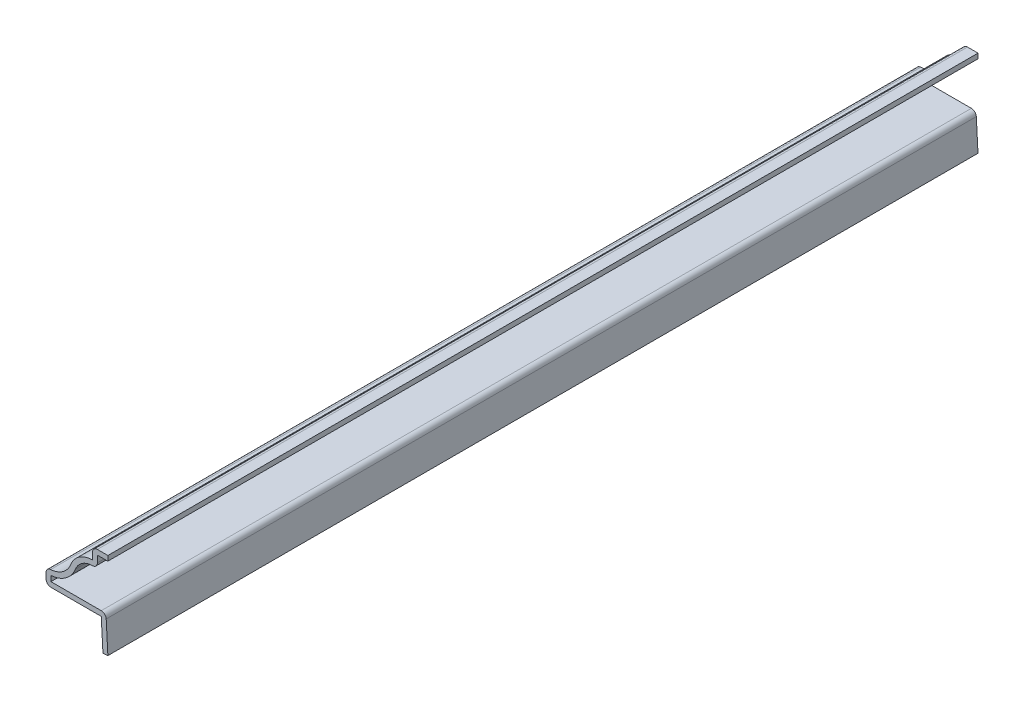
ISO-10303-21;
HEADER;
FILE_DESCRIPTION(('STEP AP214'),'2;1');
FILE_NAME('part.step','',(''),(''),'','','');
FILE_SCHEMA(('AUTOMOTIVE_DESIGN { 1 0 10303 214 1 1 1 1 }'));
ENDSEC;
DATA;
#1=APPLICATION_CONTEXT('core data for automotive mechanical design processes');
#2=APPLICATION_PROTOCOL_DEFINITION('international standard','automotive_design',2000,#1);
#3=PRODUCT_CONTEXT('',#1,'mechanical');
#4=PRODUCT('Part','Part','',(#3));
#5=PRODUCT_RELATED_PRODUCT_CATEGORY('part','',(#4));
#6=PRODUCT_DEFINITION_FORMATION('','',#4);
#7=PRODUCT_DEFINITION_CONTEXT('part definition',#1,'design');
#8=PRODUCT_DEFINITION('design','',#6,#7);
#9=PRODUCT_DEFINITION_SHAPE('','',#8);
#10=(LENGTH_UNIT() NAMED_UNIT(*) SI_UNIT(.MILLI.,.METRE.));
#11=(NAMED_UNIT(*) PLANE_ANGLE_UNIT() SI_UNIT($,.RADIAN.));
#12=(NAMED_UNIT(*) SI_UNIT($,.STERADIAN.) SOLID_ANGLE_UNIT());
#13=UNCERTAINTY_MEASURE_WITH_UNIT(LENGTH_MEASURE(1.E-05),#10,'distance_accuracy_value','');
#14=(GEOMETRIC_REPRESENTATION_CONTEXT(3) GLOBAL_UNCERTAINTY_ASSIGNED_CONTEXT((#13)) GLOBAL_UNIT_ASSIGNED_CONTEXT((#10,
#11,#12)) REPRESENTATION_CONTEXT('',''));
#15=CARTESIAN_POINT('',(0.,0.,0.));
#16=DIRECTION('',(0.,0.,1.));
#17=DIRECTION('',(1.,0.,0.));
#18=AXIS2_PLACEMENT_3D('',#15,#16,#17);
#19=CARTESIAN_POINT('',(-1.35921717219366,6.35,-178.59375));
#20=DIRECTION('',(-0.998529808230198,-0.0542053694366461,0.));
#21=DIRECTION('',(0.0542053694366461,-0.998529808230198,0.));
#22=AXIS2_PLACEMENT_3D('',#19,#20,#21);
#23=PLANE('',#22);
#24=DIRECTION('',(0.0542053694366461,-0.998529808230198,0.));
#25=VECTOR('',#24,1.);
#26=CARTESIAN_POINT('',(-1.35921717219366,6.35,0.));
#27=LINE('',#26,#25);
#28=CARTESIAN_POINT('',(-1.35921717219366,6.35,0.));
#29=VERTEX_POINT('',#28);
#30=CARTESIAN_POINT('',(-1.01450628516188,0.,0.));
#31=VERTEX_POINT('',#30);
#32=EDGE_CURVE('E240',#29,#31,#27,.T.);
#33=ORIENTED_EDGE('',*,*,#32,.F.);
#34=DIRECTION('',(0.,0.,1.));
#35=VECTOR('',#34,1.);
#36=CARTESIAN_POINT('',(-1.35921717219366,6.35,-178.59375));
#37=LINE('',#36,#35);
#38=CARTESIAN_POINT('',(-1.35921717219366,6.35,-178.59375));
#39=VERTEX_POINT('',#38);
#40=EDGE_CURVE('E204',#39,#29,#37,.T.);
#41=ORIENTED_EDGE('',*,*,#40,.F.);
#42=DIRECTION('',(0.0542053694366461,-0.998529808230198,0.));
#43=VECTOR('',#42,1.);
#44=CARTESIAN_POINT('',(-1.35921717219366,6.35,-178.59375));
#45=LINE('',#44,#43);
#46=CARTESIAN_POINT('',(-1.01450628516188,0.,-178.59375));
#47=VERTEX_POINT('',#46);
#48=EDGE_CURVE('E184',#39,#47,#45,.T.);
#49=ORIENTED_EDGE('',*,*,#48,.T.);
#50=DIRECTION('',(0.,0.,1.));
#51=VECTOR('',#50,1.);
#52=CARTESIAN_POINT('',(-1.01450628516188,0.,-178.59375));
#53=LINE('',#52,#51);
#54=EDGE_CURVE('E192',#47,#31,#53,.T.);
#55=ORIENTED_EDGE('',*,*,#54,.T.);
#56=EDGE_LOOP('',(#33,#41,#49,#55));
#57=FACE_BOUND('',#56,.T.);
#58=ADVANCED_FACE('F35',(#57),#23,.T.);
#59=CARTESIAN_POINT('',(-12.7,6.35,-178.59375));
#60=DIRECTION('',(0.,-1.,0.));
#61=DIRECTION('',(0.,0.,-1.));
#62=AXIS2_PLACEMENT_3D('',#59,#60,#61);
#63=PLANE('',#62);
#64=DIRECTION('',(1.,0.,0.));
#65=VECTOR('',#64,1.);
#66=CARTESIAN_POINT('',(-12.7,6.35,0.));
#67=LINE('',#66,#65);
#68=CARTESIAN_POINT('',(-11.684,6.35,0.));
#69=VERTEX_POINT('',#68);
#70=EDGE_CURVE('E205',#69,#29,#67,.T.);
#71=ORIENTED_EDGE('',*,*,#70,.F.);
#72=DIRECTION('',(0.,0.,1.));
#73=VECTOR('',#72,1.);
#74=CARTESIAN_POINT('',(-11.684,6.35,-178.59375));
#75=LINE('',#74,#73);
#76=CARTESIAN_POINT('',(-11.684,6.35,-178.59375));
#77=VERTEX_POINT('',#76);
#78=EDGE_CURVE('E326',#69,#77,#75,.F.);
#79=ORIENTED_EDGE('',*,*,#78,.T.);
#80=DIRECTION('',(1.,0.,0.));
#81=VECTOR('',#80,1.);
#82=CARTESIAN_POINT('',(-12.7,6.35,-178.59375));
#83=LINE('',#82,#81);
#84=EDGE_CURVE('E200',#77,#39,#83,.T.);
#85=ORIENTED_EDGE('',*,*,#84,.T.);
#86=ORIENTED_EDGE('',*,*,#40,.T.);
#87=EDGE_LOOP('',(#71,#79,#85,#86));
#88=FACE_BOUND('',#87,.T.);
#89=ADVANCED_FACE('F386',(#88),#63,.T.);
#90=CARTESIAN_POINT('',(-12.7,9.525,-178.59375));
#91=DIRECTION('',(-1.,0.,0.));
#92=DIRECTION('',(0.,0.,1.));
#93=AXIS2_PLACEMENT_3D('',#90,#91,#92);
#94=PLANE('',#93);
#95=DIRECTION('',(0.,-1.,0.));
#96=VECTOR('',#95,1.);
#97=CARTESIAN_POINT('',(-12.7,9.525,-178.59375));
#98=LINE('',#97,#96);
#99=CARTESIAN_POINT('',(-12.7,8.47084131991799,-178.59375));
#100=VERTEX_POINT('',#99);
#101=CARTESIAN_POINT('',(-12.7,7.366,-178.59375));
#102=VERTEX_POINT('',#101);
#103=EDGE_CURVE('E236',#100,#102,#98,.T.);
#104=ORIENTED_EDGE('',*,*,#103,.T.);
#105=DIRECTION('',(0.,0.,1.));
#106=VECTOR('',#105,1.);
#107=CARTESIAN_POINT('',(-12.7,7.366,-178.59375));
#108=LINE('',#107,#106);
#109=CARTESIAN_POINT('',(-12.7,7.366,0.));
#110=VERTEX_POINT('',#109);
#111=EDGE_CURVE('E323',#102,#110,#108,.T.);
#112=ORIENTED_EDGE('',*,*,#111,.T.);
#113=DIRECTION('',(0.,-1.,0.));
#114=VECTOR('',#113,1.);
#115=CARTESIAN_POINT('',(-12.7,9.525,0.));
#116=LINE('',#115,#114);
#117=CARTESIAN_POINT('',(-12.7,8.47084131991799,0.));
#118=VERTEX_POINT('',#117);
#119=EDGE_CURVE('E207',#118,#110,#116,.T.);
#120=ORIENTED_EDGE('',*,*,#119,.F.);
#121=DIRECTION('',(0.,0.,1.));
#122=VECTOR('',#121,1.);
#123=CARTESIAN_POINT('',(-12.7,8.47084131991799,-178.59375));
#124=LINE('',#123,#122);
#125=EDGE_CURVE('E321',#118,#100,#124,.F.);
#126=ORIENTED_EDGE('',*,*,#125,.T.);
#127=EDGE_LOOP('',(#104,#112,#120,#126));
#128=FACE_BOUND('',#127,.T.);
#129=ADVANCED_FACE('F377',(#128),#94,.T.);
#130=CARTESIAN_POINT('',(-12.0242503488217,14.2393152905732,-178.59375));
#131=DIRECTION('',(0.,0.,1.));
#132=DIRECTION('',(1.,0.,0.));
#133=AXIS2_PLACEMENT_3D('',#130,#131,#132);
#134=CYLINDRICAL_SURFACE('',#133,4.7625);
#135=CARTESIAN_POINT('',(-12.0242503488217,14.2393152905732,-178.59375));
#136=DIRECTION('',(0.,0.,-1.));
#137=DIRECTION('',(-1.,0.,0.));
#138=AXIS2_PLACEMENT_3D('',#135,#136,#137);
#139=CIRCLE('',#138,4.7625);
#140=CARTESIAN_POINT('',(-7.59962517441082,12.4774701452866,-178.59375));
#141=VERTEX_POINT('',#140);
#142=CARTESIAN_POINT('',(-11.7438242371555,9.48507850157165,-178.59375));
#143=VERTEX_POINT('',#142);
#144=EDGE_CURVE('E233',#141,#143,#139,.T.);
#145=ORIENTED_EDGE('',*,*,#144,.T.);
#146=DIRECTION('',(0.,0.,1.));
#147=VECTOR('',#146,1.);
#148=CARTESIAN_POINT('',(-11.7438242371555,9.48507850157165,-178.59375));
#149=LINE('',#148,#147);
#150=CARTESIAN_POINT('',(-11.7438242371555,9.48507850157165,0.));
#151=VERTEX_POINT('',#150);
#152=EDGE_CURVE('E328',#143,#151,#149,.T.);
#153=ORIENTED_EDGE('',*,*,#152,.T.);
#154=CARTESIAN_POINT('',(-12.0242503488217,14.2393152905732,0.));
#155=DIRECTION('',(0.,0.,-1.));
#156=DIRECTION('',(-1.,0.,0.));
#157=AXIS2_PLACEMENT_3D('',#154,#155,#156);
#158=CIRCLE('',#157,4.7625);
#159=CARTESIAN_POINT('',(-7.59962517441082,12.4774701452866,0.));
#160=VERTEX_POINT('',#159);
#161=EDGE_CURVE('E268',#160,#151,#158,.T.);
#162=ORIENTED_EDGE('',*,*,#161,.F.);
#163=DIRECTION('',(0.,0.,1.));
#164=VECTOR('',#163,1.);
#165=CARTESIAN_POINT('',(-7.59962517441082,12.4774701452866,-178.59375));
#166=LINE('',#165,#164);
#167=EDGE_CURVE('E275',#141,#160,#166,.T.);
#168=ORIENTED_EDGE('',*,*,#167,.F.);
#169=EDGE_LOOP('',(#145,#153,#162,#168));
#170=FACE_BOUND('',#169,.T.);
#171=ADVANCED_FACE('F369',(#170),#134,.F.);
#172=CARTESIAN_POINT('',(-3.175,10.715625,-178.59375));
#173=DIRECTION('',(0.,0.,1.));
#174=DIRECTION('',(1.,0.,0.));
#175=AXIS2_PLACEMENT_3D('',#172,#173,#174);
#176=CYLINDRICAL_SURFACE('',#175,4.7625);
#177=CARTESIAN_POINT('',(-3.175,10.715625,0.));
#178=DIRECTION('',(0.,0.,1.));
#179=DIRECTION('',(1.,0.,0.));
#180=AXIS2_PLACEMENT_3D('',#177,#178,#179);
#181=CIRCLE('',#180,4.7625);
#182=CARTESIAN_POINT('',(-3.175,15.478125,0.));
#183=VERTEX_POINT('',#182);
#184=EDGE_CURVE('E265',#183,#160,#181,.T.);
#185=ORIENTED_EDGE('',*,*,#184,.F.);
#186=DIRECTION('',(0.,0.,1.));
#187=VECTOR('',#186,1.);
#188=CARTESIAN_POINT('',(-3.175,15.478125,-178.59375));
#189=LINE('',#188,#187);
#190=CARTESIAN_POINT('',(-3.175,15.478125,-178.59375));
#191=VERTEX_POINT('',#190);
#192=EDGE_CURVE('E277',#191,#183,#189,.T.);
#193=ORIENTED_EDGE('',*,*,#192,.F.);
#194=CARTESIAN_POINT('',(-3.175,10.715625,-178.59375));
#195=DIRECTION('',(0.,0.,1.));
#196=DIRECTION('',(1.,0.,0.));
#197=AXIS2_PLACEMENT_3D('',#194,#195,#196);
#198=CIRCLE('',#197,4.7625);
#199=EDGE_CURVE('E230',#191,#141,#198,.T.);
#200=ORIENTED_EDGE('',*,*,#199,.T.);
#201=ORIENTED_EDGE('',*,*,#167,.T.);
#202=EDGE_LOOP('',(#185,#193,#200,#201));
#203=FACE_BOUND('',#202,.T.);
#204=ADVANCED_FACE('F366',(#203),#176,.T.);
#205=CARTESIAN_POINT('',(-3.175,17.859375,-178.59375));
#206=DIRECTION('',(-1.,0.,0.));
#207=DIRECTION('',(0.,0.,1.));
#208=AXIS2_PLACEMENT_3D('',#205,#206,#207);
#209=PLANE('',#208);
#210=DIRECTION('',(0.,-1.,0.));
#211=VECTOR('',#210,1.);
#212=CARTESIAN_POINT('',(-3.175,17.859375,0.));
#213=LINE('',#212,#211);
#214=CARTESIAN_POINT('',(-3.175,16.843375,0.));
#215=VERTEX_POINT('',#214);
#216=EDGE_CURVE('E263',#215,#183,#213,.T.);
#217=ORIENTED_EDGE('',*,*,#216,.F.);
#218=DIRECTION('',(0.,0.,1.));
#219=VECTOR('',#218,1.);
#220=CARTESIAN_POINT('',(-3.175,16.843375,-178.59375));
#221=LINE('',#220,#219);
#222=CARTESIAN_POINT('',(-3.175,16.843375,-178.59375));
#223=VERTEX_POINT('',#222);
#224=EDGE_CURVE('E11',#215,#223,#221,.F.);
#225=ORIENTED_EDGE('',*,*,#224,.T.);
#226=DIRECTION('',(0.,-1.,0.));
#227=VECTOR('',#226,1.);
#228=CARTESIAN_POINT('',(-3.175,17.859375,-178.59375));
#229=LINE('',#228,#227);
#230=EDGE_CURVE('E228',#223,#191,#229,.T.);
#231=ORIENTED_EDGE('',*,*,#230,.T.);
#232=ORIENTED_EDGE('',*,*,#192,.T.);
#233=EDGE_LOOP('',(#217,#225,#231,#232));
#234=FACE_BOUND('',#233,.T.);
#235=ADVANCED_FACE('F361',(#234),#209,.T.);
#236=CARTESIAN_POINT('',(0.,17.859375,-178.59375));
#237=DIRECTION('',(0.,1.,0.));
#238=DIRECTION('',(0.,0.,1.));
#239=AXIS2_PLACEMENT_3D('',#236,#237,#238);
#240=PLANE('',#239);
#241=DIRECTION('',(-1.,0.,0.));
#242=VECTOR('',#241,1.);
#243=CARTESIAN_POINT('',(0.,17.859375,-178.59375));
#244=LINE('',#243,#242);
#245=CARTESIAN_POINT('',(0.,17.859375,-178.59375));
#246=VERTEX_POINT('',#245);
#247=CARTESIAN_POINT('',(-2.159,17.859375,-178.59375));
#248=VERTEX_POINT('',#247);
#249=EDGE_CURVE('E225',#246,#248,#244,.T.);
#250=ORIENTED_EDGE('',*,*,#249,.T.);
#251=DIRECTION('',(0.,0.,1.));
#252=VECTOR('',#251,1.);
#253=CARTESIAN_POINT('',(-2.159,17.859375,-178.59375));
#254=LINE('',#253,#252);
#255=CARTESIAN_POINT('',(-2.159,17.859375,0.));
#256=VERTEX_POINT('',#255);
#257=EDGE_CURVE('E43',#248,#256,#254,.T.);
#258=ORIENTED_EDGE('',*,*,#257,.T.);
#259=DIRECTION('',(-1.,0.,0.));
#260=VECTOR('',#259,1.);
#261=CARTESIAN_POINT('',(0.,17.859375,0.));
#262=LINE('',#261,#260);
#263=CARTESIAN_POINT('',(0.,17.859375,0.));
#264=VERTEX_POINT('',#263);
#265=EDGE_CURVE('E260',#264,#256,#262,.T.);
#266=ORIENTED_EDGE('',*,*,#265,.F.);
#267=DIRECTION('',(0.,0.,1.));
#268=VECTOR('',#267,1.);
#269=CARTESIAN_POINT('',(0.,17.859375,-178.59375));
#270=LINE('',#269,#268);
#271=EDGE_CURVE('E280',#246,#264,#270,.T.);
#272=ORIENTED_EDGE('',*,*,#271,.F.);
#273=EDGE_LOOP('',(#250,#258,#266,#272));
#274=FACE_BOUND('',#273,.T.);
#275=ADVANCED_FACE('F338',(#274),#240,.T.);
#276=CARTESIAN_POINT('',(0.,17.859375,-178.59375));
#277=DIRECTION('',(-1.,0.,0.));
#278=DIRECTION('',(0.,0.,1.));
#279=AXIS2_PLACEMENT_3D('',#276,#277,#278);
#280=PLANE('',#279);
#281=DIRECTION('',(0.,-1.,0.));
#282=VECTOR('',#281,1.);
#283=CARTESIAN_POINT('',(0.,17.859375,0.));
#284=LINE('',#283,#282);
#285=CARTESIAN_POINT('',(0.,16.843375,0.));
#286=VERTEX_POINT('',#285);
#287=EDGE_CURVE('E258',#264,#286,#284,.T.);
#288=ORIENTED_EDGE('',*,*,#287,.T.);
#289=DIRECTION('',(0.,0.,1.));
#290=VECTOR('',#289,1.);
#291=CARTESIAN_POINT('',(0.,16.843375,-178.59375));
#292=LINE('',#291,#290);
#293=CARTESIAN_POINT('',(0.,16.843375,-178.59375));
#294=VERTEX_POINT('',#293);
#295=EDGE_CURVE('E282',#294,#286,#292,.T.);
#296=ORIENTED_EDGE('',*,*,#295,.F.);
#297=DIRECTION('',(0.,-1.,0.));
#298=VECTOR('',#297,1.);
#299=CARTESIAN_POINT('',(0.,17.859375,-178.59375));
#300=LINE('',#299,#298);
#301=EDGE_CURVE('E223',#246,#294,#300,.T.);
#302=ORIENTED_EDGE('',*,*,#301,.F.);
#303=ORIENTED_EDGE('',*,*,#271,.T.);
#304=EDGE_LOOP('',(#288,#296,#302,#303));
#305=FACE_BOUND('',#304,.T.);
#306=ADVANCED_FACE('F351',(#305),#280,.F.);
#307=CARTESIAN_POINT('',(0.,16.843375,-178.59375));
#308=DIRECTION('',(0.,1.,0.));
#309=DIRECTION('',(0.,0.,1.));
#310=AXIS2_PLACEMENT_3D('',#307,#308,#309);
#311=PLANE('',#310);
#312=DIRECTION('',(1.,0.,0.));
#313=VECTOR('',#312,1.);
#314=CARTESIAN_POINT('',(0.,16.843375,0.));
#315=LINE('',#314,#313);
#316=CARTESIAN_POINT('',(-2.159,16.843375,0.));
#317=VERTEX_POINT('',#316);
#318=EDGE_CURVE('E256',#286,#317,#315,.F.);
#319=ORIENTED_EDGE('',*,*,#318,.T.);
#320=DIRECTION('',(0.,0.,1.));
#321=VECTOR('',#320,1.);
#322=CARTESIAN_POINT('',(-2.159,16.843375,-178.59375));
#323=LINE('',#322,#321);
#324=CARTESIAN_POINT('',(-2.159,16.843375,-178.59375));
#325=VERTEX_POINT('',#324);
#326=EDGE_CURVE('E285',#325,#317,#323,.T.);
#327=ORIENTED_EDGE('',*,*,#326,.F.);
#328=DIRECTION('',(1.,0.,0.));
#329=VECTOR('',#328,1.);
#330=CARTESIAN_POINT('',(0.,16.843375,-178.59375));
#331=LINE('',#330,#329);
#332=EDGE_CURVE('E221',#294,#325,#331,.F.);
#333=ORIENTED_EDGE('',*,*,#332,.F.);
#334=ORIENTED_EDGE('',*,*,#295,.T.);
#335=EDGE_LOOP('',(#319,#327,#333,#334));
#336=FACE_BOUND('',#335,.T.);
#337=ADVANCED_FACE('F355',(#336),#311,.F.);
#338=CARTESIAN_POINT('',(-2.159,17.859375,-178.59375));
#339=DIRECTION('',(-1.,0.,0.));
#340=DIRECTION('',(0.,0.,1.));
#341=AXIS2_PLACEMENT_3D('',#338,#339,#340);
#342=PLANE('',#341);
#343=DIRECTION('',(0.,1.,0.));
#344=VECTOR('',#343,1.);
#345=CARTESIAN_POINT('',(-2.159,17.859375,0.));
#346=LINE('',#345,#344);
#347=CARTESIAN_POINT('',(-2.159,15.478125,0.));
#348=VERTEX_POINT('',#347);
#349=EDGE_CURVE('E254',#317,#348,#346,.F.);
#350=ORIENTED_EDGE('',*,*,#349,.T.);
#351=DIRECTION('',(0.,0.,1.));
#352=VECTOR('',#351,1.);
#353=CARTESIAN_POINT('',(-2.159,15.478125,-178.59375));
#354=LINE('',#353,#352);
#355=CARTESIAN_POINT('',(-2.159,15.478125,-178.59375));
#356=VERTEX_POINT('',#355);
#357=EDGE_CURVE('E58',#348,#356,#354,.F.);
#358=ORIENTED_EDGE('',*,*,#357,.T.);
#359=DIRECTION('',(0.,1.,0.));
#360=VECTOR('',#359,1.);
#361=CARTESIAN_POINT('',(-2.159,17.859375,-178.59375));
#362=LINE('',#361,#360);
#363=EDGE_CURVE('E219',#325,#356,#362,.F.);
#364=ORIENTED_EDGE('',*,*,#363,.F.);
#365=ORIENTED_EDGE('',*,*,#326,.T.);
#366=EDGE_LOOP('',(#350,#358,#364,#365));
#367=FACE_BOUND('',#366,.T.);
#368=ADVANCED_FACE('F415',(#367),#342,.F.);
#369=CARTESIAN_POINT('',(-3.175,10.715625,-178.59375));
#370=DIRECTION('',(0.,0.,1.));
#371=DIRECTION('',(1.,0.,0.));
#372=AXIS2_PLACEMENT_3D('',#369,#370,#371);
#373=CYLINDRICAL_SURFACE('',#372,3.7465);
#374=CARTESIAN_POINT('',(-3.175,10.715625,-178.59375));
#375=DIRECTION('',(0.,0.,1.));
#376=DIRECTION('',(1.,0.,0.));
#377=AXIS2_PLACEMENT_3D('',#374,#375,#376);
#378=CIRCLE('',#377,3.7465);
#379=CARTESIAN_POINT('',(-3.175,14.462125,-178.59375));
#380=VERTEX_POINT('',#379);
#381=CARTESIAN_POINT('',(-6.65570513720318,12.1016098476255,-178.59375));
#382=VERTEX_POINT('',#381);
#383=EDGE_CURVE('E217',#380,#382,#378,.T.);
#384=ORIENTED_EDGE('',*,*,#383,.F.);
#385=DIRECTION('',(0.,0.,1.));
#386=VECTOR('',#385,1.);
#387=CARTESIAN_POINT('',(-3.175,14.462125,-178.59375));
#388=LINE('',#387,#386);
#389=CARTESIAN_POINT('',(-3.175,14.462125,0.));
#390=VERTEX_POINT('',#389);
#391=EDGE_CURVE('E331',#380,#390,#388,.T.);
#392=ORIENTED_EDGE('',*,*,#391,.T.);
#393=CARTESIAN_POINT('',(-3.175,10.715625,0.));
#394=DIRECTION('',(0.,0.,1.));
#395=DIRECTION('',(1.,0.,0.));
#396=AXIS2_PLACEMENT_3D('',#393,#394,#395);
#397=CIRCLE('',#396,3.7465);
#398=CARTESIAN_POINT('',(-6.65570513720318,12.1016098476255,0.));
#399=VERTEX_POINT('',#398);
#400=EDGE_CURVE('E252',#390,#399,#397,.T.);
#401=ORIENTED_EDGE('',*,*,#400,.T.);
#402=DIRECTION('',(0.,0.,1.));
#403=VECTOR('',#402,1.);
#404=CARTESIAN_POINT('',(-6.65570513720318,12.1016098476255,-178.59375));
#405=LINE('',#404,#403);
#406=EDGE_CURVE('E288',#382,#399,#405,.T.);
#407=ORIENTED_EDGE('',*,*,#406,.F.);
#408=EDGE_LOOP('',(#384,#392,#401,#407));
#409=FACE_BOUND('',#408,.T.);
#410=ADVANCED_FACE('F411',(#409),#373,.F.);
#411=CARTESIAN_POINT('',(-12.0242503488217,14.2393152905732,-178.59375));
#412=DIRECTION('',(0.,0.,1.));
#413=DIRECTION('',(1.,0.,0.));
#414=AXIS2_PLACEMENT_3D('',#411,#412,#413);
#415=CYLINDRICAL_SURFACE('',#414,5.7785);
#416=CARTESIAN_POINT('',(-12.0242503488217,14.2393152905732,0.));
#417=DIRECTION('',(0.,0.,1.));
#418=DIRECTION('',(1.,0.,0.));
#419=AXIS2_PLACEMENT_3D('',#416,#417,#418);
#420=CIRCLE('',#419,5.7785);
#421=CARTESIAN_POINT('',(-11.684,8.47084131991799,0.));
#422=VERTEX_POINT('',#421);
#423=EDGE_CURVE('E250',#399,#422,#420,.F.);
#424=ORIENTED_EDGE('',*,*,#423,.T.);
#425=DIRECTION('',(0.,0.,1.));
#426=VECTOR('',#425,1.);
#427=CARTESIAN_POINT('',(-11.684,8.47084131991799,-178.59375));
#428=LINE('',#427,#426);
#429=CARTESIAN_POINT('',(-11.684,8.47084131991799,-178.59375));
#430=VERTEX_POINT('',#429);
#431=EDGE_CURVE('E291',#430,#422,#428,.T.);
#432=ORIENTED_EDGE('',*,*,#431,.F.);
#433=CARTESIAN_POINT('',(-12.0242503488217,14.2393152905732,-178.59375));
#434=DIRECTION('',(0.,0.,1.));
#435=DIRECTION('',(1.,0.,0.));
#436=AXIS2_PLACEMENT_3D('',#433,#434,#435);
#437=CIRCLE('',#436,5.7785);
#438=EDGE_CURVE('E215',#382,#430,#437,.F.);
#439=ORIENTED_EDGE('',*,*,#438,.F.);
#440=ORIENTED_EDGE('',*,*,#406,.T.);
#441=EDGE_LOOP('',(#424,#432,#439,#440));
#442=FACE_BOUND('',#441,.T.);
#443=ADVANCED_FACE('F408',(#442),#415,.T.);
#444=CARTESIAN_POINT('',(-11.684,9.525,-178.59375));
#445=DIRECTION('',(-1.,0.,0.));
#446=DIRECTION('',(0.,0.,1.));
#447=AXIS2_PLACEMENT_3D('',#444,#445,#446);
#448=PLANE('',#447);
#449=DIRECTION('',(0.,1.,0.));
#450=VECTOR('',#449,1.);
#451=CARTESIAN_POINT('',(-11.684,9.525,0.));
#452=LINE('',#451,#450);
#453=CARTESIAN_POINT('',(-11.684,7.366,0.));
#454=VERTEX_POINT('',#453);
#455=EDGE_CURVE('E248',#422,#454,#452,.F.);
#456=ORIENTED_EDGE('',*,*,#455,.T.);
#457=DIRECTION('',(0.,0.,1.));
#458=VECTOR('',#457,1.);
#459=CARTESIAN_POINT('',(-11.684,7.366,-178.59375));
#460=LINE('',#459,#458);
#461=CARTESIAN_POINT('',(-11.684,7.366,-178.59375));
#462=VERTEX_POINT('',#461);
#463=EDGE_CURVE('E294',#462,#454,#460,.T.);
#464=ORIENTED_EDGE('',*,*,#463,.F.);
#465=DIRECTION('',(0.,1.,0.));
#466=VECTOR('',#465,1.);
#467=CARTESIAN_POINT('',(-11.684,9.525,-178.59375));
#468=LINE('',#467,#466);
#469=EDGE_CURVE('E213',#430,#462,#468,.F.);
#470=ORIENTED_EDGE('',*,*,#469,.F.);
#471=ORIENTED_EDGE('',*,*,#431,.T.);
#472=EDGE_LOOP('',(#456,#464,#470,#471));
#473=FACE_BOUND('',#472,.T.);
#474=ADVANCED_FACE('F403',(#473),#448,.F.);
#475=CARTESIAN_POINT('',(-12.7,7.366,-178.59375));
#476=DIRECTION('',(0.,-1.,0.));
#477=DIRECTION('',(0.,0.,-1.));
#478=AXIS2_PLACEMENT_3D('',#475,#476,#477);
#479=PLANE('',#478);
#480=DIRECTION('',(1.,0.,0.));
#481=VECTOR('',#480,1.);
#482=CARTESIAN_POINT('',(-12.7,7.366,0.));
#483=LINE('',#482,#481);
#484=CARTESIAN_POINT('',(-1.35921717219366,7.366,0.));
#485=VERTEX_POINT('',#484);
#486=EDGE_CURVE('E245',#454,#485,#483,.T.);
#487=ORIENTED_EDGE('',*,*,#486,.T.);
#488=DIRECTION('',(0.,0.,1.));
#489=VECTOR('',#488,1.);
#490=CARTESIAN_POINT('',(-1.35921717219366,7.366,-178.59375));
#491=LINE('',#490,#489);
#492=CARTESIAN_POINT('',(-1.35921717219366,7.366,-178.59375));
#493=VERTEX_POINT('',#492);
#494=EDGE_CURVE('E310',#485,#493,#491,.F.);
#495=ORIENTED_EDGE('',*,*,#494,.T.);
#496=DIRECTION('',(1.,0.,0.));
#497=VECTOR('',#496,1.);
#498=CARTESIAN_POINT('',(-12.7,7.366,-178.59375));
#499=LINE('',#498,#497);
#500=EDGE_CURVE('E211',#462,#493,#499,.T.);
#501=ORIENTED_EDGE('',*,*,#500,.F.);
#502=ORIENTED_EDGE('',*,*,#463,.T.);
#503=EDGE_LOOP('',(#487,#495,#501,#502));
#504=FACE_BOUND('',#503,.T.);
#505=ADVANCED_FACE('F397',(#504),#479,.F.);
#506=CARTESIAN_POINT('',(-0.344710887031778,6.40507265534763,-178.59375));
#507=DIRECTION('',(-0.998529808230198,-0.0542053694366461,0.));
#508=DIRECTION('',(0.0542053694366461,-0.998529808230198,0.));
#509=AXIS2_PLACEMENT_3D('',#506,#507,#508);
#510=PLANE('',#509);
#511=DIRECTION('',(0.0542053694366461,-0.998529808230198,0.));
#512=VECTOR('',#511,1.);
#513=CARTESIAN_POINT('',(-0.344710887031778,6.40507265534763,-178.59375));
#514=LINE('',#513,#512);
#515=CARTESIAN_POINT('',(-0.344710887031778,6.40507265534763,-178.59375));
#516=VERTEX_POINT('',#515);
#517=CARTESIAN_POINT('',(0.,0.0550726553476336,-178.59375));
#518=VERTEX_POINT('',#517);
#519=EDGE_CURVE('E186',#516,#518,#514,.T.);
#520=ORIENTED_EDGE('',*,*,#519,.F.);
#521=DIRECTION('',(0.,0.,1.));
#522=VECTOR('',#521,1.);
#523=CARTESIAN_POINT('',(-0.344710887031778,6.40507265534763,-178.59375));
#524=LINE('',#523,#522);
#525=CARTESIAN_POINT('',(-0.344710887031778,6.40507265534763,0.));
#526=VERTEX_POINT('',#525);
#527=EDGE_CURVE('E274',#516,#526,#524,.T.);
#528=ORIENTED_EDGE('',*,*,#527,.T.);
#529=DIRECTION('',(0.0542053694366461,-0.998529808230198,0.));
#530=VECTOR('',#529,1.);
#531=CARTESIAN_POINT('',(-0.344710887031778,6.40507265534763,0.));
#532=LINE('',#531,#530);
#533=CARTESIAN_POINT('',(0.,0.0550726553476336,0.));
#534=VERTEX_POINT('',#533);
#535=EDGE_CURVE('E243',#526,#534,#532,.T.);
#536=ORIENTED_EDGE('',*,*,#535,.T.);
#537=DIRECTION('',(0.,0.,1.));
#538=VECTOR('',#537,1.);
#539=CARTESIAN_POINT('',(0.,0.0550726553476336,-178.59375));
#540=LINE('',#539,#538);
#541=EDGE_CURVE('E199',#518,#534,#540,.T.);
#542=ORIENTED_EDGE('',*,*,#541,.F.);
#543=EDGE_LOOP('',(#520,#528,#536,#542));
#544=FACE_BOUND('',#543,.T.);
#545=ADVANCED_FACE('F389',(#544),#510,.F.);
#546=CARTESIAN_POINT('',(0.,0.0550726553476336,-178.59375));
#547=DIRECTION('',(-0.0542053694366472,0.998529808230198,0.));
#548=DIRECTION('',(-0.998529808230198,-0.0542053694366472,0.));
#549=AXIS2_PLACEMENT_3D('',#546,#547,#548);
#550=PLANE('',#549);
#551=DIRECTION('',(-0.998529808230198,-0.0542053694366472,0.));
#552=VECTOR('',#551,1.);
#553=CARTESIAN_POINT('',(0.,0.0550726553476336,0.));
#554=LINE('',#553,#552);
#555=EDGE_CURVE('E195',#534,#31,#554,.T.);
#556=ORIENTED_EDGE('',*,*,#555,.T.);
#557=ORIENTED_EDGE('',*,*,#54,.F.);
#558=DIRECTION('',(-0.998529808230198,-0.0542053694366472,0.));
#559=VECTOR('',#558,1.);
#560=CARTESIAN_POINT('',(0.,0.0550726553476336,-178.59375));
#561=LINE('',#560,#559);
#562=EDGE_CURVE('E178',#518,#47,#561,.T.);
#563=ORIENTED_EDGE('',*,*,#562,.F.);
#564=ORIENTED_EDGE('',*,*,#541,.T.);
#565=EDGE_LOOP('',(#556,#557,#563,#564));
#566=FACE_BOUND('',#565,.T.);
#567=ADVANCED_FACE('F193',(#566),#550,.F.);
#568=CARTESIAN_POINT('',(-12.0242503488217,14.2393152905732,-178.59375));
#569=DIRECTION('',(0.,0.,1.));
#570=DIRECTION('',(1.,0.,0.));
#571=AXIS2_PLACEMENT_3D('',#568,#569,#570);
#572=PLANE('',#571);
#573=ORIENTED_EDGE('',*,*,#500,.T.);
#574=CARTESIAN_POINT('',(-1.35921717219366,6.35,-178.59375));
#575=DIRECTION('',(0.,0.,1.));
#576=DIRECTION('',(1.,0.,0.));
#577=AXIS2_PLACEMENT_3D('',#574,#575,#576);
#578=CIRCLE('',#577,1.016);
#579=EDGE_CURVE('E319',#493,#516,#578,.F.);
#580=ORIENTED_EDGE('',*,*,#579,.T.);
#581=ORIENTED_EDGE('',*,*,#519,.T.);
#582=ORIENTED_EDGE('',*,*,#562,.T.);
#583=ORIENTED_EDGE('',*,*,#48,.F.);
#584=ORIENTED_EDGE('',*,*,#84,.F.);
#585=CARTESIAN_POINT('',(-11.684,7.366,-178.59375));
#586=DIRECTION('',(0.,0.,1.));
#587=DIRECTION('',(1.,0.,0.));
#588=AXIS2_PLACEMENT_3D('',#585,#586,#587);
#589=CIRCLE('',#588,1.016);
#590=EDGE_CURVE('E317',#77,#102,#589,.F.);
#591=ORIENTED_EDGE('',*,*,#590,.T.);
#592=ORIENTED_EDGE('',*,*,#103,.F.);
#593=CARTESIAN_POINT('',(-11.684,8.47084131991799,-178.59375));
#594=DIRECTION('',(0.,0.,1.));
#595=DIRECTION('',(1.,0.,0.));
#596=AXIS2_PLACEMENT_3D('',#593,#594,#595);
#597=CIRCLE('',#596,1.016);
#598=EDGE_CURVE('E315',#100,#143,#597,.F.);
#599=ORIENTED_EDGE('',*,*,#598,.T.);
#600=ORIENTED_EDGE('',*,*,#144,.F.);
#601=ORIENTED_EDGE('',*,*,#199,.F.);
#602=ORIENTED_EDGE('',*,*,#230,.F.);
#603=CARTESIAN_POINT('',(-2.159,16.843375,-178.59375));
#604=DIRECTION('',(0.,0.,1.));
#605=DIRECTION('',(1.,0.,0.));
#606=AXIS2_PLACEMENT_3D('',#603,#604,#605);
#607=CIRCLE('',#606,1.016);
#608=EDGE_CURVE('E312',#223,#248,#607,.F.);
#609=ORIENTED_EDGE('',*,*,#608,.T.);
#610=ORIENTED_EDGE('',*,*,#249,.F.);
#611=ORIENTED_EDGE('',*,*,#301,.T.);
#612=ORIENTED_EDGE('',*,*,#332,.T.);
#613=ORIENTED_EDGE('',*,*,#363,.T.);
#614=CARTESIAN_POINT('',(-3.175,15.478125,-178.59375));
#615=DIRECTION('',(0.,0.,1.));
#616=DIRECTION('',(1.,0.,0.));
#617=AXIS2_PLACEMENT_3D('',#614,#615,#616);
#618=CIRCLE('',#617,1.016);
#619=EDGE_CURVE('E50',#356,#380,#618,.F.);
#620=ORIENTED_EDGE('',*,*,#619,.T.);
#621=ORIENTED_EDGE('',*,*,#383,.T.);
#622=ORIENTED_EDGE('',*,*,#438,.T.);
#623=ORIENTED_EDGE('',*,*,#469,.T.);
#624=EDGE_LOOP('',(#573,#580,#581,#582,#583,#584,#591,#592,#599,#600,#601,#602,#609,#610,#611,
#612,#613,#620,#621,#622,#623));
#625=FACE_BOUND('',#624,.T.);
#626=ADVANCED_FACE('F181',(#625),#572,.F.);
#627=CARTESIAN_POINT('',(-12.0242503488217,14.2393152905732,0.));
#628=DIRECTION('',(0.,0.,1.));
#629=DIRECTION('',(1.,0.,0.));
#630=AXIS2_PLACEMENT_3D('',#627,#628,#629);
#631=PLANE('',#630);
#632=ORIENTED_EDGE('',*,*,#535,.F.);
#633=CARTESIAN_POINT('',(-1.35921717219366,6.35,0.));
#634=DIRECTION('',(0.,0.,1.));
#635=DIRECTION('',(1.,0.,0.));
#636=AXIS2_PLACEMENT_3D('',#633,#634,#635);
#637=CIRCLE('',#636,1.016);
#638=EDGE_CURVE('E308',#526,#485,#637,.T.);
#639=ORIENTED_EDGE('',*,*,#638,.T.);
#640=ORIENTED_EDGE('',*,*,#486,.F.);
#641=ORIENTED_EDGE('',*,*,#455,.F.);
#642=ORIENTED_EDGE('',*,*,#423,.F.);
#643=ORIENTED_EDGE('',*,*,#400,.F.);
#644=CARTESIAN_POINT('',(-3.175,15.478125,0.));
#645=DIRECTION('',(0.,0.,1.));
#646=DIRECTION('',(1.,0.,0.));
#647=AXIS2_PLACEMENT_3D('',#644,#645,#646);
#648=CIRCLE('',#647,1.016);
#649=EDGE_CURVE('E302',#390,#348,#648,.T.);
#650=ORIENTED_EDGE('',*,*,#649,.T.);
#651=ORIENTED_EDGE('',*,*,#349,.F.);
#652=ORIENTED_EDGE('',*,*,#318,.F.);
#653=ORIENTED_EDGE('',*,*,#287,.F.);
#654=ORIENTED_EDGE('',*,*,#265,.T.);
#655=CARTESIAN_POINT('',(-2.159,16.843375,0.));
#656=DIRECTION('',(0.,0.,1.));
#657=DIRECTION('',(1.,0.,0.));
#658=AXIS2_PLACEMENT_3D('',#655,#656,#657);
#659=CIRCLE('',#658,1.016);
#660=EDGE_CURVE('E300',#256,#215,#659,.T.);
#661=ORIENTED_EDGE('',*,*,#660,.T.);
#662=ORIENTED_EDGE('',*,*,#216,.T.);
#663=ORIENTED_EDGE('',*,*,#184,.T.);
#664=ORIENTED_EDGE('',*,*,#161,.T.);
#665=CARTESIAN_POINT('',(-11.684,8.47084131991799,0.));
#666=DIRECTION('',(0.,0.,1.));
#667=DIRECTION('',(1.,0.,0.));
#668=AXIS2_PLACEMENT_3D('',#665,#666,#667);
#669=CIRCLE('',#668,1.016);
#670=EDGE_CURVE('E304',#151,#118,#669,.T.);
#671=ORIENTED_EDGE('',*,*,#670,.T.);
#672=ORIENTED_EDGE('',*,*,#119,.T.);
#673=CARTESIAN_POINT('',(-11.684,7.366,0.));
#674=DIRECTION('',(0.,0.,1.));
#675=DIRECTION('',(1.,0.,0.));
#676=AXIS2_PLACEMENT_3D('',#673,#674,#675);
#677=CIRCLE('',#676,1.016);
#678=EDGE_CURVE('E306',#110,#69,#677,.T.);
#679=ORIENTED_EDGE('',*,*,#678,.T.);
#680=ORIENTED_EDGE('',*,*,#70,.T.);
#681=ORIENTED_EDGE('',*,*,#32,.T.);
#682=ORIENTED_EDGE('',*,*,#555,.F.);
#683=EDGE_LOOP('',(#632,#639,#640,#641,#642,#643,#650,#651,#652,#653,#654,#661,#662,#663,#664,
#671,#672,#679,#680,#681,#682));
#684=FACE_BOUND('',#683,.T.);
#685=ADVANCED_FACE('F345',(#684),#631,.T.);
#686=CARTESIAN_POINT('',(-1.35921717219366,6.35,-178.59375));
#687=DIRECTION('',(0.,0.,1.));
#688=DIRECTION('',(1.,0.,0.));
#689=AXIS2_PLACEMENT_3D('',#686,#687,#688);
#690=CYLINDRICAL_SURFACE('',#689,1.016);
#691=ORIENTED_EDGE('',*,*,#579,.F.);
#692=ORIENTED_EDGE('',*,*,#494,.F.);
#693=ORIENTED_EDGE('',*,*,#638,.F.);
#694=ORIENTED_EDGE('',*,*,#527,.F.);
#695=EDGE_LOOP('',(#691,#692,#693,#694));
#696=FACE_BOUND('',#695,.T.);
#697=ADVANCED_FACE('F393',(#696),#690,.T.);
#698=CARTESIAN_POINT('',(-11.684,7.366,-178.59375));
#699=DIRECTION('',(0.,0.,1.));
#700=DIRECTION('',(1.,0.,0.));
#701=AXIS2_PLACEMENT_3D('',#698,#699,#700);
#702=CYLINDRICAL_SURFACE('',#701,1.016);
#703=ORIENTED_EDGE('',*,*,#590,.F.);
#704=ORIENTED_EDGE('',*,*,#78,.F.);
#705=ORIENTED_EDGE('',*,*,#678,.F.);
#706=ORIENTED_EDGE('',*,*,#111,.F.);
#707=EDGE_LOOP('',(#703,#704,#705,#706));
#708=FACE_BOUND('',#707,.T.);
#709=ADVANCED_FACE('F382',(#708),#702,.T.);
#710=CARTESIAN_POINT('',(-11.684,8.47084131991799,-178.59375));
#711=DIRECTION('',(0.,0.,1.));
#712=DIRECTION('',(1.,0.,0.));
#713=AXIS2_PLACEMENT_3D('',#710,#711,#712);
#714=CYLINDRICAL_SURFACE('',#713,1.016);
#715=ORIENTED_EDGE('',*,*,#598,.F.);
#716=ORIENTED_EDGE('',*,*,#125,.F.);
#717=ORIENTED_EDGE('',*,*,#670,.F.);
#718=ORIENTED_EDGE('',*,*,#152,.F.);
#719=EDGE_LOOP('',(#715,#716,#717,#718));
#720=FACE_BOUND('',#719,.T.);
#721=ADVANCED_FACE('F373',(#720),#714,.T.);
#722=CARTESIAN_POINT('',(-3.175,15.478125,-178.59375));
#723=DIRECTION('',(0.,0.,1.));
#724=DIRECTION('',(1.,0.,0.));
#725=AXIS2_PLACEMENT_3D('',#722,#723,#724);
#726=CYLINDRICAL_SURFACE('',#725,1.016);
#727=ORIENTED_EDGE('',*,*,#619,.F.);
#728=ORIENTED_EDGE('',*,*,#357,.F.);
#729=ORIENTED_EDGE('',*,*,#649,.F.);
#730=ORIENTED_EDGE('',*,*,#391,.F.);
#731=EDGE_LOOP('',(#727,#728,#729,#730));
#732=FACE_BOUND('',#731,.T.);
#733=ADVANCED_FACE('F414',(#732),#726,.T.);
#734=CARTESIAN_POINT('',(-2.159,16.843375,-178.59375));
#735=DIRECTION('',(0.,0.,1.));
#736=DIRECTION('',(1.,0.,0.));
#737=AXIS2_PLACEMENT_3D('',#734,#735,#736);
#738=CYLINDRICAL_SURFACE('',#737,1.016);
#739=ORIENTED_EDGE('',*,*,#608,.F.);
#740=ORIENTED_EDGE('',*,*,#224,.F.);
#741=ORIENTED_EDGE('',*,*,#660,.F.);
#742=ORIENTED_EDGE('',*,*,#257,.F.);
#743=EDGE_LOOP('',(#739,#740,#741,#742));
#744=FACE_BOUND('',#743,.T.);
#745=ADVANCED_FACE('F37',(#744),#738,.T.);
#746=CLOSED_SHELL('',(#58,#89,#129,#171,#204,#235,#275,#306,#337,#368,#410,#443,#474,#505,#545,
#567,#626,#685,#697,#709,#721,#733,#745));
#747=MANIFOLD_SOLID_BREP('B2',#746);
#748=ADVANCED_BREP_SHAPE_REPRESENTATION('',(#18,#747),#14);
#749=SHAPE_DEFINITION_REPRESENTATION(#9,#748);
ENDSEC;
END-ISO-10303-21;
